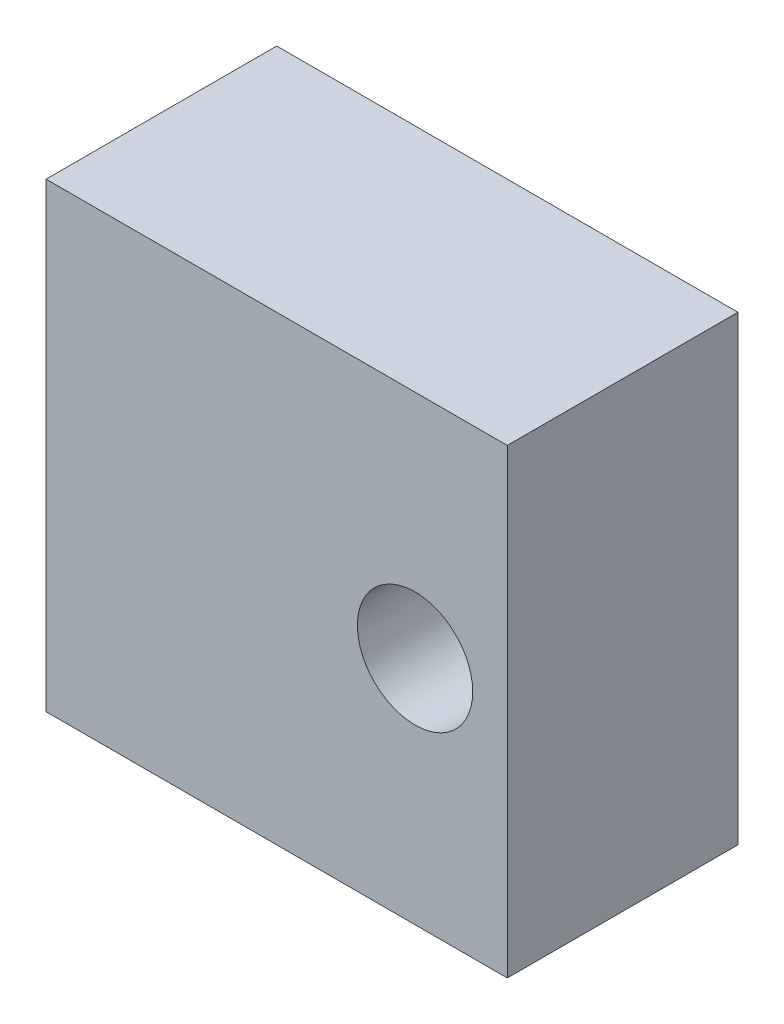
ISO-10303-21;
HEADER;
FILE_DESCRIPTION(('STEP AP214'),'2;1');
FILE_NAME('part.step','',(''),(''),'','','');
FILE_SCHEMA(('AUTOMOTIVE_DESIGN { 1 0 10303 214 1 1 1 1 }'));
ENDSEC;
DATA;
#1=APPLICATION_CONTEXT('core data for automotive mechanical design processes');
#2=APPLICATION_PROTOCOL_DEFINITION('international standard','automotive_design',2000,#1);
#3=PRODUCT_CONTEXT('',#1,'mechanical');
#4=PRODUCT('Part','Part','',(#3));
#5=PRODUCT_RELATED_PRODUCT_CATEGORY('part','',(#4));
#6=PRODUCT_DEFINITION_FORMATION('','',#4);
#7=PRODUCT_DEFINITION_CONTEXT('part definition',#1,'design');
#8=PRODUCT_DEFINITION('design','',#6,#7);
#9=PRODUCT_DEFINITION_SHAPE('','',#8);
#10=(LENGTH_UNIT() NAMED_UNIT(*) SI_UNIT(.MILLI.,.METRE.));
#11=(NAMED_UNIT(*) PLANE_ANGLE_UNIT() SI_UNIT($,.RADIAN.));
#12=(NAMED_UNIT(*) SI_UNIT($,.STERADIAN.) SOLID_ANGLE_UNIT());
#13=UNCERTAINTY_MEASURE_WITH_UNIT(LENGTH_MEASURE(1.E-05),#10,'distance_accuracy_value','');
#14=(GEOMETRIC_REPRESENTATION_CONTEXT(3) GLOBAL_UNCERTAINTY_ASSIGNED_CONTEXT((#13)) GLOBAL_UNIT_ASSIGNED_CONTEXT((#10,
#11,#12)) REPRESENTATION_CONTEXT('',''));
#15=CARTESIAN_POINT('',(0.,0.,0.));
#16=DIRECTION('',(0.,0.,1.));
#17=DIRECTION('',(1.,0.,0.));
#18=AXIS2_PLACEMENT_3D('',#15,#16,#17);
#19=CARTESIAN_POINT('',(-8.60869565217391,6.91304347826087,10.));
#20=DIRECTION('',(1.,0.,0.));
#21=DIRECTION('',(0.,1.,0.));
#22=AXIS2_PLACEMENT_3D('',#19,#20,#21);
#23=PLANE('',#22);
#24=DIRECTION('',(0.,-1.,0.));
#25=VECTOR('',#24,1.);
#26=CARTESIAN_POINT('',(-8.60869565217391,6.91304347826087,0.));
#27=LINE('',#26,#25);
#28=CARTESIAN_POINT('',(-8.60869565217391,6.91304347826087,0.));
#29=VERTEX_POINT('',#28);
#30=CARTESIAN_POINT('',(-8.6086956521739,-13.0869565217391,0.));
#31=VERTEX_POINT('',#30);
#32=EDGE_CURVE('E106',#29,#31,#27,.T.);
#33=ORIENTED_EDGE('',*,*,#32,.T.);
#34=DIRECTION('',(0.,0.,-1.));
#35=VECTOR('',#34,1.);
#36=CARTESIAN_POINT('',(-8.6086956521739,-13.0869565217391,10.));
#37=LINE('',#36,#35);
#38=CARTESIAN_POINT('',(-8.6086956521739,-13.0869565217391,10.));
#39=VERTEX_POINT('',#38);
#40=EDGE_CURVE('E11',#39,#31,#37,.T.);
#41=ORIENTED_EDGE('',*,*,#40,.F.);
#42=DIRECTION('',(0.,-1.,0.));
#43=VECTOR('',#42,1.);
#44=CARTESIAN_POINT('',(-8.60869565217391,6.91304347826087,10.));
#45=LINE('',#44,#43);
#46=CARTESIAN_POINT('',(-8.60869565217391,6.91304347826087,10.));
#47=VERTEX_POINT('',#46);
#48=EDGE_CURVE('E90',#47,#39,#45,.T.);
#49=ORIENTED_EDGE('',*,*,#48,.F.);
#50=DIRECTION('',(0.,0.,-1.));
#51=VECTOR('',#50,1.);
#52=CARTESIAN_POINT('',(-8.60869565217391,6.91304347826087,10.));
#53=LINE('',#52,#51);
#54=EDGE_CURVE('E102',#47,#29,#53,.T.);
#55=ORIENTED_EDGE('',*,*,#54,.T.);
#56=EDGE_LOOP('',(#33,#41,#49,#55));
#57=FACE_BOUND('',#56,.T.);
#58=ADVANCED_FACE('F38',(#57),#23,.F.);
#59=CARTESIAN_POINT('',(-8.6086956521739,-13.0869565217391,10.));
#60=DIRECTION('',(0.,1.,0.));
#61=DIRECTION('',(0.,0.,1.));
#62=AXIS2_PLACEMENT_3D('',#59,#60,#61);
#63=PLANE('',#62);
#64=DIRECTION('',(1.,0.,0.));
#65=VECTOR('',#64,1.);
#66=CARTESIAN_POINT('',(-8.6086956521739,-13.0869565217391,0.));
#67=LINE('',#66,#65);
#68=CARTESIAN_POINT('',(11.3913043478261,-13.0869565217391,0.));
#69=VERTEX_POINT('',#68);
#70=EDGE_CURVE('E95',#31,#69,#67,.T.);
#71=ORIENTED_EDGE('',*,*,#70,.T.);
#72=DIRECTION('',(0.,0.,-1.));
#73=VECTOR('',#72,1.);
#74=CARTESIAN_POINT('',(11.3913043478261,-13.0869565217391,10.));
#75=LINE('',#74,#73);
#76=CARTESIAN_POINT('',(11.3913043478261,-13.0869565217391,10.));
#77=VERTEX_POINT('',#76);
#78=EDGE_CURVE('E47',#77,#69,#75,.T.);
#79=ORIENTED_EDGE('',*,*,#78,.F.);
#80=DIRECTION('',(1.,0.,0.));
#81=VECTOR('',#80,1.);
#82=CARTESIAN_POINT('',(-8.6086956521739,-13.0869565217391,10.));
#83=LINE('',#82,#81);
#84=EDGE_CURVE('E85',#39,#77,#83,.T.);
#85=ORIENTED_EDGE('',*,*,#84,.F.);
#86=ORIENTED_EDGE('',*,*,#40,.T.);
#87=EDGE_LOOP('',(#71,#79,#85,#86));
#88=FACE_BOUND('',#87,.T.);
#89=ADVANCED_FACE('F94',(#88),#63,.F.);
#90=CARTESIAN_POINT('',(11.3913043478261,6.91304347826087,10.));
#91=DIRECTION('',(-1.,0.,0.));
#92=DIRECTION('',(0.,-1.,0.));
#93=AXIS2_PLACEMENT_3D('',#90,#91,#92);
#94=PLANE('',#93);
#95=DIRECTION('',(0.,1.,0.));
#96=VECTOR('',#95,1.);
#97=CARTESIAN_POINT('',(11.3913043478261,6.91304347826087,0.));
#98=LINE('',#97,#96);
#99=CARTESIAN_POINT('',(11.3913043478261,6.91304347826087,0.));
#100=VERTEX_POINT('',#99);
#101=EDGE_CURVE('E72',#69,#100,#98,.T.);
#102=ORIENTED_EDGE('',*,*,#101,.T.);
#103=DIRECTION('',(0.,0.,-1.));
#104=VECTOR('',#103,1.);
#105=CARTESIAN_POINT('',(11.3913043478261,6.91304347826087,10.));
#106=LINE('',#105,#104);
#107=CARTESIAN_POINT('',(11.3913043478261,6.91304347826087,10.));
#108=VERTEX_POINT('',#107);
#109=EDGE_CURVE('E97',#108,#100,#106,.T.);
#110=ORIENTED_EDGE('',*,*,#109,.F.);
#111=DIRECTION('',(0.,1.,0.));
#112=VECTOR('',#111,1.);
#113=CARTESIAN_POINT('',(11.3913043478261,6.91304347826087,10.));
#114=LINE('',#113,#112);
#115=EDGE_CURVE('E88',#77,#108,#114,.T.);
#116=ORIENTED_EDGE('',*,*,#115,.F.);
#117=ORIENTED_EDGE('',*,*,#78,.T.);
#118=EDGE_LOOP('',(#102,#110,#116,#117));
#119=FACE_BOUND('',#118,.T.);
#120=ADVANCED_FACE('F98',(#119),#94,.F.);
#121=CARTESIAN_POINT('',(-8.60869565217391,6.91304347826087,10.));
#122=DIRECTION('',(0.,-1.,0.));
#123=DIRECTION('',(0.,0.,-1.));
#124=AXIS2_PLACEMENT_3D('',#121,#122,#123);
#125=PLANE('',#124);
#126=DIRECTION('',(-1.,0.,0.));
#127=VECTOR('',#126,1.);
#128=CARTESIAN_POINT('',(-8.60869565217391,6.91304347826087,0.));
#129=LINE('',#128,#127);
#130=EDGE_CURVE('E78',#100,#29,#129,.T.);
#131=ORIENTED_EDGE('',*,*,#130,.T.);
#132=ORIENTED_EDGE('',*,*,#54,.F.);
#133=DIRECTION('',(-1.,0.,0.));
#134=VECTOR('',#133,1.);
#135=CARTESIAN_POINT('',(-8.60869565217391,6.91304347826087,10.));
#136=LINE('',#135,#134);
#137=EDGE_CURVE('E55',#108,#47,#136,.T.);
#138=ORIENTED_EDGE('',*,*,#137,.F.);
#139=ORIENTED_EDGE('',*,*,#109,.T.);
#140=EDGE_LOOP('',(#131,#132,#138,#139));
#141=FACE_BOUND('',#140,.T.);
#142=ADVANCED_FACE('F120',(#141),#125,.F.);
#143=CARTESIAN_POINT('',(0.,0.,10.));
#144=DIRECTION('',(0.,0.,1.));
#145=DIRECTION('',(1.,0.,0.));
#146=AXIS2_PLACEMENT_3D('',#143,#144,#145);
#147=PLANE('',#146);
#148=CARTESIAN_POINT('',(7.3913043478261,-3.08695652173913,10.));
#149=DIRECTION('',(0.,0.,1.));
#150=DIRECTION('',(1.,0.,0.));
#151=AXIS2_PLACEMENT_3D('',#148,#149,#150);
#152=CIRCLE('',#151,2.5);
#153=CARTESIAN_POINT('',(9.8913043478261,-3.08695652173913,10.));
#154=VERTEX_POINT('',#153);
#155=EDGE_CURVE('E127',#154,#154,#152,.T.);
#156=ORIENTED_EDGE('',*,*,#155,.F.);
#157=EDGE_LOOP('',(#156));
#158=FACE_BOUND('',#157,.T.);
#159=ORIENTED_EDGE('',*,*,#48,.T.);
#160=ORIENTED_EDGE('',*,*,#84,.T.);
#161=ORIENTED_EDGE('',*,*,#115,.T.);
#162=ORIENTED_EDGE('',*,*,#137,.T.);
#163=EDGE_LOOP('',(#159,#160,#161,#162));
#164=FACE_BOUND('',#163,.T.);
#165=ADVANCED_FACE('F86',(#158,#164),#147,.T.);
#166=CARTESIAN_POINT('',(0.,0.,0.));
#167=DIRECTION('',(0.,0.,1.));
#168=DIRECTION('',(1.,0.,0.));
#169=AXIS2_PLACEMENT_3D('',#166,#167,#168);
#170=PLANE('',#169);
#171=CARTESIAN_POINT('',(7.3913043478261,-3.08695652173913,0.));
#172=DIRECTION('',(0.,0.,1.));
#173=DIRECTION('',(1.,0.,0.));
#174=AXIS2_PLACEMENT_3D('',#171,#172,#173);
#175=CIRCLE('',#174,2.5);
#176=CARTESIAN_POINT('',(9.8913043478261,-3.08695652173913,0.));
#177=VERTEX_POINT('',#176);
#178=EDGE_CURVE('E110',#177,#177,#175,.T.);
#179=ORIENTED_EDGE('',*,*,#178,.T.);
#180=EDGE_LOOP('',(#179));
#181=FACE_BOUND('',#180,.T.);
#182=ORIENTED_EDGE('',*,*,#32,.F.);
#183=ORIENTED_EDGE('',*,*,#130,.F.);
#184=ORIENTED_EDGE('',*,*,#101,.F.);
#185=ORIENTED_EDGE('',*,*,#70,.F.);
#186=EDGE_LOOP('',(#182,#183,#184,#185));
#187=FACE_BOUND('',#186,.T.);
#188=ADVANCED_FACE('F123',(#181,#187),#170,.F.);
#189=CARTESIAN_POINT('',(7.3913043478261,-3.08695652173913,0.));
#190=DIRECTION('',(0.,0.,1.));
#191=DIRECTION('',(1.,0.,0.));
#192=AXIS2_PLACEMENT_3D('',#189,#190,#191);
#193=CYLINDRICAL_SURFACE('',#192,2.5);
#194=ORIENTED_EDGE('',*,*,#178,.F.);
#195=EDGE_LOOP('',(#194));
#196=FACE_BOUND('',#195,.T.);
#197=ORIENTED_EDGE('',*,*,#155,.T.);
#198=EDGE_LOOP('',(#197));
#199=FACE_BOUND('',#198,.T.);
#200=ADVANCED_FACE('F136',(#196,#199),#193,.F.);
#201=CLOSED_SHELL('',(#58,#89,#120,#142,#165,#188,#200));
#202=MANIFOLD_SOLID_BREP('B2',#201);
#203=ADVANCED_BREP_SHAPE_REPRESENTATION('',(#18,#202),#14);
#204=SHAPE_DEFINITION_REPRESENTATION(#9,#203);
ENDSEC;
END-ISO-10303-21;
